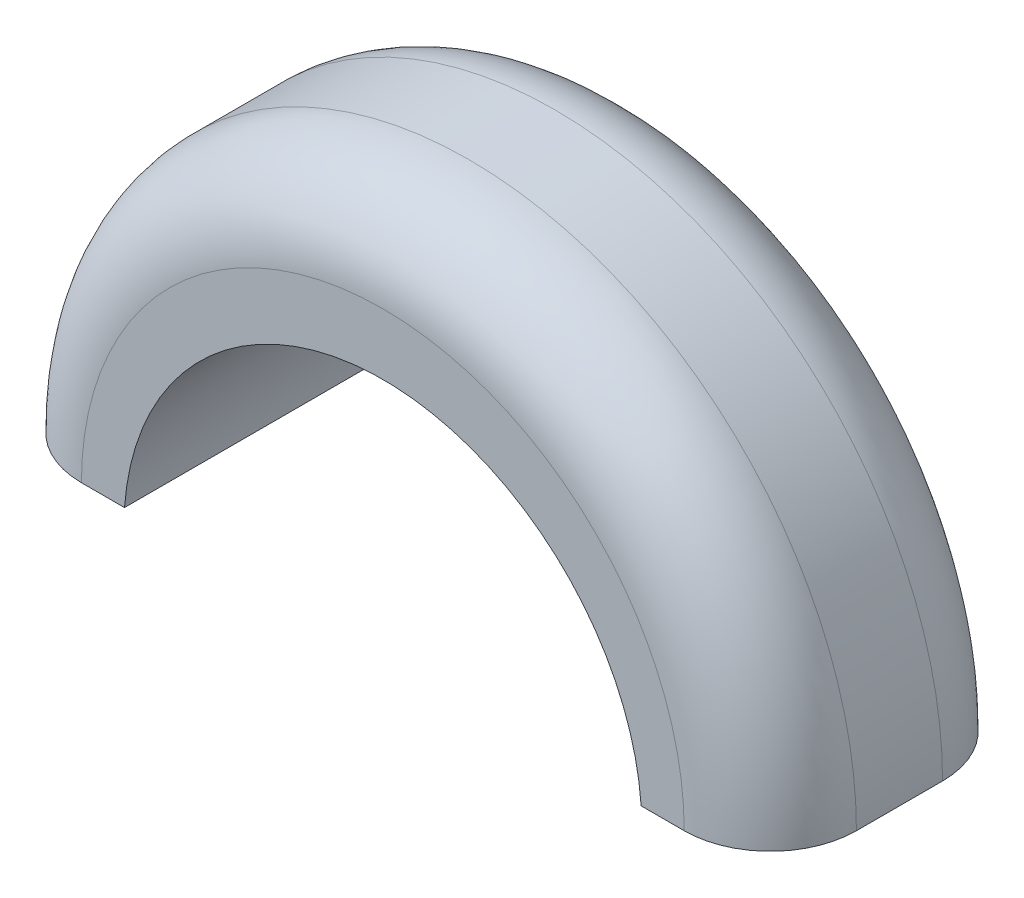
ISO-10303-21;
HEADER;
FILE_DESCRIPTION(('STEP AP214'),'2;1');
FILE_NAME('part.step','',(''),(''),'','','');
FILE_SCHEMA(('AUTOMOTIVE_DESIGN { 1 0 10303 214 1 1 1 1 }'));
ENDSEC;
DATA;
#1=APPLICATION_CONTEXT('core data for automotive mechanical design processes');
#2=APPLICATION_PROTOCOL_DEFINITION('international standard','automotive_design',2000,#1);
#3=PRODUCT_CONTEXT('',#1,'mechanical');
#4=PRODUCT('Part','Part','',(#3));
#5=PRODUCT_RELATED_PRODUCT_CATEGORY('part','',(#4));
#6=PRODUCT_DEFINITION_FORMATION('','',#4);
#7=PRODUCT_DEFINITION_CONTEXT('part definition',#1,'design');
#8=PRODUCT_DEFINITION('design','',#6,#7);
#9=PRODUCT_DEFINITION_SHAPE('','',#8);
#10=(LENGTH_UNIT() NAMED_UNIT(*) SI_UNIT(.MILLI.,.METRE.));
#11=(NAMED_UNIT(*) PLANE_ANGLE_UNIT() SI_UNIT($,.RADIAN.));
#12=(NAMED_UNIT(*) SI_UNIT($,.STERADIAN.) SOLID_ANGLE_UNIT());
#13=UNCERTAINTY_MEASURE_WITH_UNIT(LENGTH_MEASURE(1.E-05),#10,'distance_accuracy_value','');
#14=(GEOMETRIC_REPRESENTATION_CONTEXT(3) GLOBAL_UNCERTAINTY_ASSIGNED_CONTEXT((#13)) GLOBAL_UNIT_ASSIGNED_CONTEXT((#10,
#11,#12)) REPRESENTATION_CONTEXT('',''));
#15=CARTESIAN_POINT('',(0.,0.,0.));
#16=DIRECTION('',(0.,0.,1.));
#17=DIRECTION('',(1.,0.,0.));
#18=AXIS2_PLACEMENT_3D('',#15,#16,#17);
#19=CARTESIAN_POINT('',(1.143,0.,0.762));
#20=DIRECTION('',(0.,0.,-1.));
#21=DIRECTION('',(-1.,0.,0.));
#22=AXIS2_PLACEMENT_3D('',#19,#20,#21);
#23=CYLINDRICAL_SURFACE('',#22,1.143);
#24=DIRECTION('',(0.,0.,-1.));
#25=VECTOR('',#24,1.);
#26=CARTESIAN_POINT('',(2.286,0.,0.762));
#27=LINE('',#26,#25);
#28=CARTESIAN_POINT('',(2.286,0.,0.508));
#29=VERTEX_POINT('',#28);
#30=CARTESIAN_POINT('',(2.286,0.,0.254));
#31=VERTEX_POINT('',#30);
#32=EDGE_CURVE('E124',#29,#31,#27,.T.);
#33=ORIENTED_EDGE('',*,*,#32,.T.);
#34=CARTESIAN_POINT('',(1.143,0.,0.254));
#35=DIRECTION('',(0.,0.,-1.));
#36=DIRECTION('',(-1.,0.,0.));
#37=AXIS2_PLACEMENT_3D('',#34,#35,#36);
#38=CIRCLE('',#37,1.143);
#39=CARTESIAN_POINT('',(0.,0.,0.254));
#40=VERTEX_POINT('',#39);
#41=EDGE_CURVE('E144',#31,#40,#38,.F.);
#42=ORIENTED_EDGE('',*,*,#41,.T.);
#43=DIRECTION('',(0.,0.,-1.));
#44=VECTOR('',#43,1.);
#45=CARTESIAN_POINT('',(0.,0.,0.762));
#46=LINE('',#45,#44);
#47=CARTESIAN_POINT('',(0.,0.,0.508));
#48=VERTEX_POINT('',#47);
#49=EDGE_CURVE('E115',#48,#40,#46,.T.);
#50=ORIENTED_EDGE('',*,*,#49,.F.);
#51=CARTESIAN_POINT('',(1.143,0.,0.508));
#52=DIRECTION('',(0.,0.,-1.));
#53=DIRECTION('',(-1.,0.,0.));
#54=AXIS2_PLACEMENT_3D('',#51,#52,#53);
#55=CIRCLE('',#54,1.143);
#56=EDGE_CURVE('E141',#48,#29,#55,.T.);
#57=ORIENTED_EDGE('',*,*,#56,.T.);
#58=EDGE_LOOP('',(#33,#42,#50,#57));
#59=FACE_BOUND('',#58,.T.);
#60=ADVANCED_FACE('F39',(#59),#23,.T.);
#61=CARTESIAN_POINT('',(0.,0.,0.762));
#62=DIRECTION('',(0.,1.,0.));
#63=DIRECTION('',(0.,0.,1.));
#64=AXIS2_PLACEMENT_3D('',#61,#62,#63);
#65=PLANE('',#64);
#66=ORIENTED_EDGE('',*,*,#49,.T.);
#67=CARTESIAN_POINT('',(0.254,0.,0.254));
#68=DIRECTION('',(0.,1.,0.));
#69=DIRECTION('',(0.,0.,1.));
#70=AXIS2_PLACEMENT_3D('',#67,#68,#69);
#71=CIRCLE('',#70,0.254);
#72=CARTESIAN_POINT('',(0.254,0.,0.));
#73=VERTEX_POINT('',#72);
#74=EDGE_CURVE('E151',#40,#73,#71,.F.);
#75=ORIENTED_EDGE('',*,*,#74,.T.);
#76=DIRECTION('',(1.,0.,0.));
#77=VECTOR('',#76,1.);
#78=CARTESIAN_POINT('',(0.,0.,0.));
#79=LINE('',#78,#77);
#80=CARTESIAN_POINT('',(0.381,0.,0.));
#81=VERTEX_POINT('',#80);
#82=EDGE_CURVE('E111',#73,#81,#79,.T.);
#83=ORIENTED_EDGE('',*,*,#82,.T.);
#84=DIRECTION('',(0.,0.,-1.));
#85=VECTOR('',#84,1.);
#86=CARTESIAN_POINT('',(0.381,0.,0.762));
#87=LINE('',#86,#85);
#88=CARTESIAN_POINT('',(0.381,0.,0.762));
#89=VERTEX_POINT('',#88);
#90=EDGE_CURVE('E108',#89,#81,#87,.T.);
#91=ORIENTED_EDGE('',*,*,#90,.F.);
#92=DIRECTION('',(1.,0.,0.));
#93=VECTOR('',#92,1.);
#94=CARTESIAN_POINT('',(0.,0.,0.762));
#95=LINE('',#94,#93);
#96=CARTESIAN_POINT('',(0.254,0.,0.762));
#97=VERTEX_POINT('',#96);
#98=EDGE_CURVE('E96',#97,#89,#95,.T.);
#99=ORIENTED_EDGE('',*,*,#98,.F.);
#100=CARTESIAN_POINT('',(0.254,0.,0.508));
#101=DIRECTION('',(0.,1.,0.));
#102=DIRECTION('',(0.,0.,1.));
#103=AXIS2_PLACEMENT_3D('',#100,#101,#102);
#104=CIRCLE('',#103,0.254);
#105=EDGE_CURVE('E148',#97,#48,#104,.F.);
#106=ORIENTED_EDGE('',*,*,#105,.T.);
#107=EDGE_LOOP('',(#66,#75,#83,#91,#99,#106));
#108=FACE_BOUND('',#107,.T.);
#109=ADVANCED_FACE('F110',(#108),#65,.F.);
#110=CARTESIAN_POINT('',(1.143,-0.0555375985570028,0.762));
#111=DIRECTION('',(0.,0.,-1.));
#112=DIRECTION('',(-1.,0.,0.));
#113=AXIS2_PLACEMENT_3D('',#110,#111,#112);
#114=CYLINDRICAL_SURFACE('',#113,0.764021220159151);
#115=CARTESIAN_POINT('',(1.143,-0.0555375985570028,0.));
#116=DIRECTION('',(0.,0.,-1.));
#117=DIRECTION('',(-1.,0.,0.));
#118=AXIS2_PLACEMENT_3D('',#115,#116,#117);
#119=CIRCLE('',#118,0.764021220159151);
#120=CARTESIAN_POINT('',(1.905,0.,0.));
#121=VERTEX_POINT('',#120);
#122=EDGE_CURVE('E129',#81,#121,#119,.T.);
#123=ORIENTED_EDGE('',*,*,#122,.T.);
#124=DIRECTION('',(0.,0.,-1.));
#125=VECTOR('',#124,1.);
#126=CARTESIAN_POINT('',(1.905,0.,0.762));
#127=LINE('',#126,#125);
#128=CARTESIAN_POINT('',(1.905,0.,0.762));
#129=VERTEX_POINT('',#128);
#130=EDGE_CURVE('E116',#129,#121,#127,.T.);
#131=ORIENTED_EDGE('',*,*,#130,.F.);
#132=CARTESIAN_POINT('',(1.143,-0.0555375985570028,0.762));
#133=DIRECTION('',(0.,0.,-1.));
#134=DIRECTION('',(-1.,0.,0.));
#135=AXIS2_PLACEMENT_3D('',#132,#133,#134);
#136=CIRCLE('',#135,0.764021220159151);
#137=EDGE_CURVE('E100',#89,#129,#136,.T.);
#138=ORIENTED_EDGE('',*,*,#137,.F.);
#139=ORIENTED_EDGE('',*,*,#90,.T.);
#140=EDGE_LOOP('',(#123,#131,#138,#139));
#141=FACE_BOUND('',#140,.T.);
#142=ADVANCED_FACE('F118',(#141),#114,.F.);
#143=CARTESIAN_POINT('',(1.905,0.,0.762));
#144=DIRECTION('',(0.,1.,0.));
#145=DIRECTION('',(0.,0.,1.));
#146=AXIS2_PLACEMENT_3D('',#143,#144,#145);
#147=PLANE('',#146);
#148=DIRECTION('',(1.,0.,0.));
#149=VECTOR('',#148,1.);
#150=CARTESIAN_POINT('',(1.905,0.,0.));
#151=LINE('',#150,#149);
#152=CARTESIAN_POINT('',(2.032,0.,0.));
#153=VERTEX_POINT('',#152);
#154=EDGE_CURVE('E105',#121,#153,#151,.T.);
#155=ORIENTED_EDGE('',*,*,#154,.T.);
#156=CARTESIAN_POINT('',(2.032,0.,0.254));
#157=DIRECTION('',(0.,1.,0.));
#158=DIRECTION('',(0.,0.,1.));
#159=AXIS2_PLACEMENT_3D('',#156,#157,#158);
#160=CIRCLE('',#159,0.254);
#161=EDGE_CURVE('E48',#153,#31,#160,.F.);
#162=ORIENTED_EDGE('',*,*,#161,.T.);
#163=ORIENTED_EDGE('',*,*,#32,.F.);
#164=CARTESIAN_POINT('',(2.032,0.,0.508));
#165=DIRECTION('',(0.,1.,0.));
#166=DIRECTION('',(0.,0.,1.));
#167=AXIS2_PLACEMENT_3D('',#164,#165,#166);
#168=CIRCLE('',#167,0.254);
#169=CARTESIAN_POINT('',(2.032,0.,0.762));
#170=VERTEX_POINT('',#169);
#171=EDGE_CURVE('E55',#29,#170,#168,.F.);
#172=ORIENTED_EDGE('',*,*,#171,.T.);
#173=DIRECTION('',(1.,0.,0.));
#174=VECTOR('',#173,1.);
#175=CARTESIAN_POINT('',(1.905,0.,0.762));
#176=LINE('',#175,#174);
#177=EDGE_CURVE('E121',#129,#170,#176,.T.);
#178=ORIENTED_EDGE('',*,*,#177,.F.);
#179=ORIENTED_EDGE('',*,*,#130,.T.);
#180=EDGE_LOOP('',(#155,#162,#163,#172,#178,#179));
#181=FACE_BOUND('',#180,.T.);
#182=ADVANCED_FACE('F159',(#181),#147,.F.);
#183=CARTESIAN_POINT('',(1.143,0.,0.762));
#184=DIRECTION('',(0.,0.,-1.));
#185=DIRECTION('',(-1.,0.,0.));
#186=AXIS2_PLACEMENT_3D('',#183,#184,#185);
#187=PLANE('',#186);
#188=ORIENTED_EDGE('',*,*,#177,.T.);
#189=CARTESIAN_POINT('',(1.143,0.,0.762));
#190=DIRECTION('',(0.,0.,-1.));
#191=DIRECTION('',(-1.,0.,0.));
#192=AXIS2_PLACEMENT_3D('',#189,#190,#191);
#193=CIRCLE('',#192,0.889);
#194=EDGE_CURVE('E11',#170,#97,#193,.F.);
#195=ORIENTED_EDGE('',*,*,#194,.T.);
#196=ORIENTED_EDGE('',*,*,#98,.T.);
#197=ORIENTED_EDGE('',*,*,#137,.T.);
#198=EDGE_LOOP('',(#188,#195,#196,#197));
#199=FACE_BOUND('',#198,.T.);
#200=ADVANCED_FACE('F98',(#199),#187,.F.);
#201=CARTESIAN_POINT('',(1.143,0.,0.));
#202=DIRECTION('',(0.,0.,-1.));
#203=DIRECTION('',(-1.,0.,0.));
#204=AXIS2_PLACEMENT_3D('',#201,#202,#203);
#205=PLANE('',#204);
#206=ORIENTED_EDGE('',*,*,#82,.F.);
#207=CARTESIAN_POINT('',(1.143,0.,0.));
#208=DIRECTION('',(0.,0.,-1.));
#209=DIRECTION('',(-1.,0.,0.));
#210=AXIS2_PLACEMENT_3D('',#207,#208,#209);
#211=CIRCLE('',#210,0.889);
#212=EDGE_CURVE('E63',#73,#153,#211,.T.);
#213=ORIENTED_EDGE('',*,*,#212,.T.);
#214=ORIENTED_EDGE('',*,*,#154,.F.);
#215=ORIENTED_EDGE('',*,*,#122,.F.);
#216=EDGE_LOOP('',(#206,#213,#214,#215));
#217=FACE_BOUND('',#216,.T.);
#218=ADVANCED_FACE('F166',(#217),#205,.T.);
#219=CARTESIAN_POINT('',(1.143,0.,0.254));
#220=DIRECTION('',(0.,0.,-1.));
#221=DIRECTION('',(-1.,0.,0.));
#222=AXIS2_PLACEMENT_3D('',#219,#220,#221);
#223=TOROIDAL_SURFACE('',#222,0.889,0.254);
#224=ORIENTED_EDGE('',*,*,#161,.F.);
#225=ORIENTED_EDGE('',*,*,#212,.F.);
#226=ORIENTED_EDGE('',*,*,#74,.F.);
#227=ORIENTED_EDGE('',*,*,#41,.F.);
#228=EDGE_LOOP('',(#224,#225,#226,#227));
#229=FACE_BOUND('',#228,.T.);
#230=ADVANCED_FACE('F165',(#229),#223,.T.);
#231=CARTESIAN_POINT('',(1.143,0.,0.508));
#232=DIRECTION('',(0.,0.,-1.));
#233=DIRECTION('',(-1.,0.,0.));
#234=AXIS2_PLACEMENT_3D('',#231,#232,#233);
#235=TOROIDAL_SURFACE('',#234,0.889,0.254);
#236=ORIENTED_EDGE('',*,*,#171,.F.);
#237=ORIENTED_EDGE('',*,*,#56,.F.);
#238=ORIENTED_EDGE('',*,*,#105,.F.);
#239=ORIENTED_EDGE('',*,*,#194,.F.);
#240=EDGE_LOOP('',(#236,#237,#238,#239));
#241=FACE_BOUND('',#240,.T.);
#242=ADVANCED_FACE('F41',(#241),#235,.T.);
#243=CLOSED_SHELL('',(#60,#109,#142,#182,#200,#218,#230,#242));
#244=MANIFOLD_SOLID_BREP('B2',#243);
#245=ADVANCED_BREP_SHAPE_REPRESENTATION('',(#18,#244),#14);
#246=SHAPE_DEFINITION_REPRESENTATION(#9,#245);
ENDSEC;
END-ISO-10303-21;
